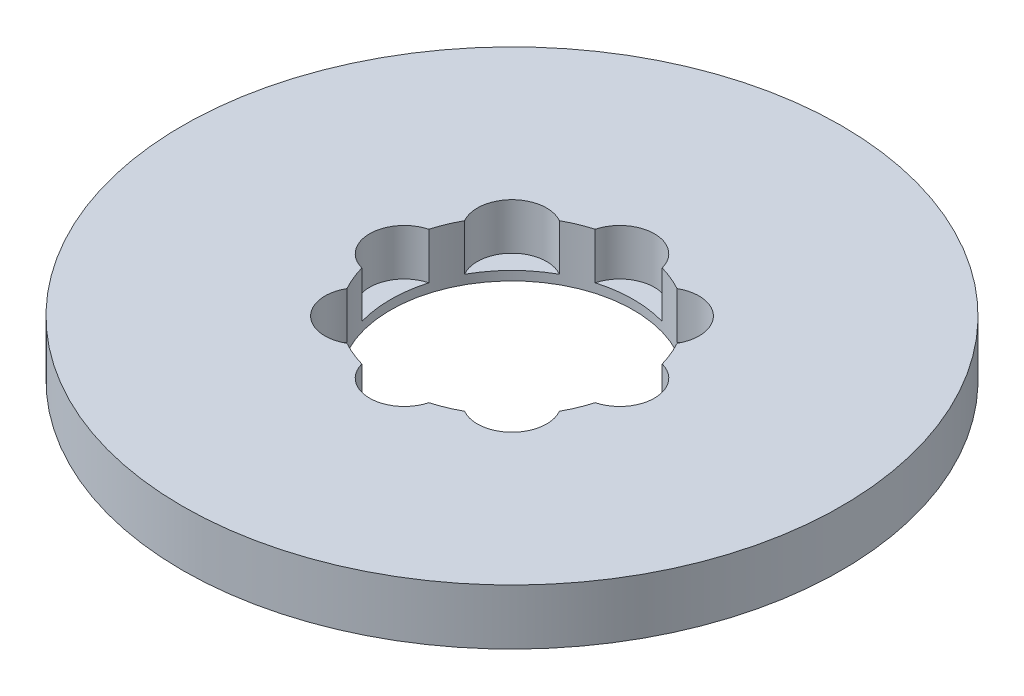
ISO-10303-21;
HEADER;
FILE_DESCRIPTION(('STEP AP214'),'2;1');
FILE_NAME('part.step','',(''),(''),'','','');
FILE_SCHEMA(('AUTOMOTIVE_DESIGN { 1 0 10303 214 1 1 1 1 }'));
ENDSEC;
DATA;
#1=APPLICATION_CONTEXT('core data for automotive mechanical design processes');
#2=APPLICATION_PROTOCOL_DEFINITION('international standard','automotive_design',2000,#1);
#3=PRODUCT_CONTEXT('',#1,'mechanical');
#4=PRODUCT('Part','Part','',(#3));
#5=PRODUCT_RELATED_PRODUCT_CATEGORY('part','',(#4));
#6=PRODUCT_DEFINITION_FORMATION('','',#4);
#7=PRODUCT_DEFINITION_CONTEXT('part definition',#1,'design');
#8=PRODUCT_DEFINITION('design','',#6,#7);
#9=PRODUCT_DEFINITION_SHAPE('','',#8);
#10=(LENGTH_UNIT() NAMED_UNIT(*) SI_UNIT(.MILLI.,.METRE.));
#11=(NAMED_UNIT(*) PLANE_ANGLE_UNIT() SI_UNIT($,.RADIAN.));
#12=(NAMED_UNIT(*) SI_UNIT($,.STERADIAN.) SOLID_ANGLE_UNIT());
#13=UNCERTAINTY_MEASURE_WITH_UNIT(LENGTH_MEASURE(1.E-05),#10,'distance_accuracy_value','');
#14=(GEOMETRIC_REPRESENTATION_CONTEXT(3) GLOBAL_UNCERTAINTY_ASSIGNED_CONTEXT((#13)) GLOBAL_UNIT_ASSIGNED_CONTEXT((#10,
#11,#12)) REPRESENTATION_CONTEXT('',''));
#15=CARTESIAN_POINT('',(0.,0.,0.));
#16=DIRECTION('',(0.,0.,1.));
#17=DIRECTION('',(1.,0.,0.));
#18=AXIS2_PLACEMENT_3D('',#15,#16,#17);
#19=CARTESIAN_POINT('',(0.,16.,0.));
#20=DIRECTION('',(0.,-1.,0.));
#21=DIRECTION('',(0.,0.,-1.));
#22=AXIS2_PLACEMENT_3D('',#19,#20,#21);
#23=CYLINDRICAL_SURFACE('',#22,95.);
#24=CARTESIAN_POINT('',(0.,16.,0.));
#25=DIRECTION('',(0.,1.,0.));
#26=DIRECTION('',(0.,0.,1.));
#27=AXIS2_PLACEMENT_3D('',#24,#25,#26);
#28=CIRCLE('',#27,95.);
#29=CARTESIAN_POINT('',(0.,16.,95.));
#30=VERTEX_POINT('',#29);
#31=EDGE_CURVE('E183',#30,#30,#28,.T.);
#32=ORIENTED_EDGE('',*,*,#31,.F.);
#33=EDGE_LOOP('',(#32));
#34=FACE_BOUND('',#33,.T.);
#35=CARTESIAN_POINT('',(0.,0.,0.));
#36=DIRECTION('',(0.,1.,0.));
#37=DIRECTION('',(0.,0.,1.));
#38=AXIS2_PLACEMENT_3D('',#35,#36,#37);
#39=CIRCLE('',#38,95.);
#40=CARTESIAN_POINT('',(0.,0.,95.));
#41=VERTEX_POINT('',#40);
#42=EDGE_CURVE('E182',#41,#41,#39,.T.);
#43=ORIENTED_EDGE('',*,*,#42,.T.);
#44=EDGE_LOOP('',(#43));
#45=FACE_BOUND('',#44,.T.);
#46=ADVANCED_FACE('F39',(#34,#45),#23,.T.);
#47=CARTESIAN_POINT('',(0.,16.,0.));
#48=DIRECTION('',(0.,1.,0.));
#49=DIRECTION('',(0.,0.,1.));
#50=AXIS2_PLACEMENT_3D('',#47,#48,#49);
#51=PLANE('',#50);
#52=CARTESIAN_POINT('',(1.0843446571775E-13,16.,31.0568653228656));
#53=DIRECTION('',(0.,1.,0.));
#54=DIRECTION('',(1.,0.,0.));
#55=AXIS2_PLACEMENT_3D('',#52,#53,#54);
#56=CIRCLE('',#55,10.);
#57=CARTESIAN_POINT('',(-9.66051258268906,16.,33.6403700431447));
#58=VERTEX_POINT('',#57);
#59=CARTESIAN_POINT('',(9.66051258268929,16.,33.6403700431446));
#60=VERTEX_POINT('',#59);
#61=EDGE_CURVE('E256',#58,#60,#56,.T.);
#62=ORIENTED_EDGE('',*,*,#61,.F.);
#63=CARTESIAN_POINT('',(0.,16.,0.));
#64=DIRECTION('',(0.,1.,0.));
#65=DIRECTION('',(0.,0.,1.));
#66=AXIS2_PLACEMENT_3D('',#63,#64,#65);
#67=CIRCLE('',#66,35.);
#68=CARTESIAN_POINT('',(-16.9563198221748,16.,30.6183477360899));
#69=VERTEX_POINT('',#68);
#70=EDGE_CURVE('E175',#69,#58,#67,.T.);
#71=ORIENTED_EDGE('',*,*,#70,.F.);
#72=CARTESIAN_POINT('',(-21.9605200721956,16.,21.9605200721957));
#73=DIRECTION('',(0.,1.,0.));
#74=DIRECTION('',(0.707106781186549,0.,0.707106781186546));
#75=AXIS2_PLACEMENT_3D('',#72,#73,#74);
#76=CIRCLE('',#75,10.);
#77=CARTESIAN_POINT('',(-30.6183477360898,16.,16.956319822175));
#78=VERTEX_POINT('',#77);
#79=EDGE_CURVE('E152',#78,#69,#76,.T.);
#80=ORIENTED_EDGE('',*,*,#79,.F.);
#81=CARTESIAN_POINT('',(-33.6403700431447,16.,9.66051258268918));
#82=VERTEX_POINT('',#81);
#83=EDGE_CURVE('E168',#82,#78,#67,.T.);
#84=ORIENTED_EDGE('',*,*,#83,.F.);
#85=CARTESIAN_POINT('',(-31.0568653228656,16.,0.));
#86=DIRECTION('',(0.,1.,0.));
#87=DIRECTION('',(0.,0.,1.));
#88=AXIS2_PLACEMENT_3D('',#85,#86,#87);
#89=CIRCLE('',#88,10.);
#90=CARTESIAN_POINT('',(-33.6403700431447,16.,-9.66051258268918));
#91=VERTEX_POINT('',#90);
#92=EDGE_CURVE('E205',#91,#82,#89,.T.);
#93=ORIENTED_EDGE('',*,*,#92,.F.);
#94=CARTESIAN_POINT('',(-30.6183477360901,16.,-16.9563198221745));
#95=VERTEX_POINT('',#94);
#96=EDGE_CURVE('E181',#95,#91,#67,.T.);
#97=ORIENTED_EDGE('',*,*,#96,.F.);
#98=CARTESIAN_POINT('',(-21.9605200721959,16.,-21.9605200721953));
#99=DIRECTION('',(0.,1.,0.));
#100=DIRECTION('',(-0.707106781186539,0.,0.707106781186556));
#101=AXIS2_PLACEMENT_3D('',#98,#99,#100);
#102=CIRCLE('',#101,10.);
#103=CARTESIAN_POINT('',(-16.9563198221753,16.,-30.6183477360897));
#104=VERTEX_POINT('',#103);
#105=EDGE_CURVE('E453',#104,#95,#102,.T.);
#106=ORIENTED_EDGE('',*,*,#105,.F.);
#107=CARTESIAN_POINT('',(-9.66051258268953,16.,-33.6403700431446));
#108=VERTEX_POINT('',#107);
#109=EDGE_CURVE('E189',#108,#104,#67,.T.);
#110=ORIENTED_EDGE('',*,*,#109,.F.);
#111=CARTESIAN_POINT('',(-3.25303397153249E-13,16.,-31.0568653228656));
#112=DIRECTION('',(0.,1.,0.));
#113=DIRECTION('',(-1.,0.,0.));
#114=AXIS2_PLACEMENT_3D('',#111,#112,#113);
#115=CIRCLE('',#114,10.);
#116=CARTESIAN_POINT('',(9.66051258268882,16.,-33.6403700431448));
#117=VERTEX_POINT('',#116);
#118=EDGE_CURVE('E462',#117,#108,#115,.T.);
#119=ORIENTED_EDGE('',*,*,#118,.F.);
#120=CARTESIAN_POINT('',(16.9563198221746,16.,-30.61834773609));
#121=VERTEX_POINT('',#120);
#122=EDGE_CURVE('E197',#121,#117,#67,.T.);
#123=ORIENTED_EDGE('',*,*,#122,.F.);
#124=CARTESIAN_POINT('',(21.9605200721954,16.,-21.9605200721958));
#125=DIRECTION('',(0.,1.,0.));
#126=DIRECTION('',(-0.707106781186554,0.,-0.707106781186541));
#127=AXIS2_PLACEMENT_3D('',#124,#125,#126);
#128=CIRCLE('',#127,10.);
#129=CARTESIAN_POINT('',(30.6183477360897,16.,-16.9563198221752));
#130=VERTEX_POINT('',#129);
#131=EDGE_CURVE('E470',#130,#121,#128,.T.);
#132=ORIENTED_EDGE('',*,*,#131,.F.);
#133=CARTESIAN_POINT('',(33.6403700431447,16.,-9.66051258268918));
#134=VERTEX_POINT('',#133);
#135=EDGE_CURVE('E489',#134,#130,#67,.T.);
#136=ORIENTED_EDGE('',*,*,#135,.F.);
#137=CARTESIAN_POINT('',(31.0568653228656,16.,0.));
#138=DIRECTION('',(0.,1.,0.));
#139=DIRECTION('',(0.,0.,-1.));
#140=AXIS2_PLACEMENT_3D('',#137,#138,#139);
#141=CIRCLE('',#140,10.);
#142=CARTESIAN_POINT('',(33.6403700431447,16.,9.66051258268918));
#143=VERTEX_POINT('',#142);
#144=EDGE_CURVE('E476',#143,#134,#141,.T.);
#145=ORIENTED_EDGE('',*,*,#144,.F.);
#146=CARTESIAN_POINT('',(30.61834773609,16.,16.9563198221747));
#147=VERTEX_POINT('',#146);
#148=EDGE_CURVE('E491',#147,#143,#67,.T.);
#149=ORIENTED_EDGE('',*,*,#148,.F.);
#150=CARTESIAN_POINT('',(21.9605200721957,16.,21.9605200721955));
#151=DIRECTION('',(0.,1.,0.));
#152=DIRECTION('',(0.707106781186544,0.,-0.707106781186551));
#153=AXIS2_PLACEMENT_3D('',#150,#151,#152);
#154=CIRCLE('',#153,10.);
#155=CARTESIAN_POINT('',(16.9563198221751,16.,30.6183477360898));
#156=VERTEX_POINT('',#155);
#157=EDGE_CURVE('E475',#156,#147,#154,.T.);
#158=ORIENTED_EDGE('',*,*,#157,.F.);
#159=EDGE_CURVE('E190',#60,#156,#67,.T.);
#160=ORIENTED_EDGE('',*,*,#159,.F.);
#161=EDGE_LOOP('',(#62,#71,#80,#84,#93,#97,#106,#110,#119,#123,#132,#136,#145,#149,#158,#160));
#162=FACE_BOUND('',#161,.T.);
#163=ORIENTED_EDGE('',*,*,#31,.T.);
#164=EDGE_LOOP('',(#163));
#165=FACE_BOUND('',#164,.T.);
#166=ADVANCED_FACE('F170',(#162,#165),#51,.T.);
#167=CARTESIAN_POINT('',(0.,0.,0.));
#168=DIRECTION('',(0.,1.,0.));
#169=DIRECTION('',(0.,0.,1.));
#170=AXIS2_PLACEMENT_3D('',#167,#168,#169);
#171=PLANE('',#170);
#172=CARTESIAN_POINT('',(0.,0.,0.));
#173=DIRECTION('',(0.,1.,0.));
#174=DIRECTION('',(0.,0.,1.));
#175=AXIS2_PLACEMENT_3D('',#172,#173,#174);
#176=CIRCLE('',#175,35.);
#177=CARTESIAN_POINT('',(0.,0.,35.));
#178=VERTEX_POINT('',#177);
#179=EDGE_CURVE('E191',#178,#178,#176,.T.);
#180=ORIENTED_EDGE('',*,*,#179,.T.);
#181=EDGE_LOOP('',(#180));
#182=FACE_BOUND('',#181,.T.);
#183=ORIENTED_EDGE('',*,*,#42,.F.);
#184=EDGE_LOOP('',(#183));
#185=FACE_BOUND('',#184,.T.);
#186=ADVANCED_FACE('F277',(#182,#185),#171,.F.);
#187=CARTESIAN_POINT('',(0.,16.,0.));
#188=DIRECTION('',(0.,-1.,0.));
#189=DIRECTION('',(0.,0.,-1.));
#190=AXIS2_PLACEMENT_3D('',#187,#188,#189);
#191=CYLINDRICAL_SURFACE('',#190,35.);
#192=DIRECTION('',(0.,1.,0.));
#193=VECTOR('',#192,1.);
#194=CARTESIAN_POINT('',(-9.66051258268906,9.31506286766782,33.6403700431447));
#195=LINE('',#194,#193);
#196=CARTESIAN_POINT('',(-9.66051258268906,2.63012573533564,33.6403700431447));
#197=VERTEX_POINT('',#196);
#198=EDGE_CURVE('E11',#197,#58,#195,.T.);
#199=ORIENTED_EDGE('',*,*,#198,.F.);
#200=CARTESIAN_POINT('',(0.,2.63012573533564,0.));
#201=DIRECTION('',(0.,1.,0.));
#202=DIRECTION('',(0.,0.,1.));
#203=AXIS2_PLACEMENT_3D('',#200,#201,#202);
#204=CIRCLE('',#203,35.);
#205=CARTESIAN_POINT('',(9.66051258268929,2.63012573533564,33.6403700431446));
#206=VERTEX_POINT('',#205);
#207=EDGE_CURVE('E251',#197,#206,#204,.T.);
#208=ORIENTED_EDGE('',*,*,#207,.T.);
#209=DIRECTION('',(0.,1.,0.));
#210=VECTOR('',#209,1.);
#211=CARTESIAN_POINT('',(9.66051258268929,9.31506286766782,33.6403700431446));
#212=LINE('',#211,#210);
#213=EDGE_CURVE('E46',#60,#206,#212,.F.);
#214=ORIENTED_EDGE('',*,*,#213,.F.);
#215=ORIENTED_EDGE('',*,*,#159,.T.);
#216=DIRECTION('',(0.,1.,0.));
#217=VECTOR('',#216,1.);
#218=CARTESIAN_POINT('',(16.9563198221751,9.31506286766782,30.6183477360898));
#219=LINE('',#218,#217);
#220=CARTESIAN_POINT('',(16.9563198221751,2.63012573533564,30.6183477360898));
#221=VERTEX_POINT('',#220);
#222=EDGE_CURVE('E253',#221,#156,#219,.T.);
#223=ORIENTED_EDGE('',*,*,#222,.F.);
#224=CARTESIAN_POINT('',(0.,2.63012573533564,0.));
#225=DIRECTION('',(0.,1.,0.));
#226=DIRECTION('',(0.,0.,1.));
#227=AXIS2_PLACEMENT_3D('',#224,#225,#226);
#228=CIRCLE('',#227,35.);
#229=CARTESIAN_POINT('',(30.61834773609,2.63012573533564,16.9563198221747));
#230=VERTEX_POINT('',#229);
#231=EDGE_CURVE('E246',#221,#230,#228,.T.);
#232=ORIENTED_EDGE('',*,*,#231,.T.);
#233=DIRECTION('',(0.,1.,0.));
#234=VECTOR('',#233,1.);
#235=CARTESIAN_POINT('',(30.61834773609,9.31506286766782,16.9563198221747));
#236=LINE('',#235,#234);
#237=EDGE_CURVE('E248',#147,#230,#236,.F.);
#238=ORIENTED_EDGE('',*,*,#237,.F.);
#239=ORIENTED_EDGE('',*,*,#148,.T.);
#240=DIRECTION('',(0.,1.,0.));
#241=VECTOR('',#240,1.);
#242=CARTESIAN_POINT('',(33.6403700431447,9.31506286766782,9.66051258268918));
#243=LINE('',#242,#241);
#244=CARTESIAN_POINT('',(33.6403700431447,2.63012573533564,9.66051258268918));
#245=VERTEX_POINT('',#244);
#246=EDGE_CURVE('E243',#245,#143,#243,.T.);
#247=ORIENTED_EDGE('',*,*,#246,.F.);
#248=CARTESIAN_POINT('',(0.,2.63012573533564,0.));
#249=DIRECTION('',(0.,1.,0.));
#250=DIRECTION('',(0.,0.,1.));
#251=AXIS2_PLACEMENT_3D('',#248,#249,#250);
#252=CIRCLE('',#251,35.);
#253=CARTESIAN_POINT('',(33.6403700431447,2.63012573533564,-9.66051258268918));
#254=VERTEX_POINT('',#253);
#255=EDGE_CURVE('E236',#245,#254,#252,.T.);
#256=ORIENTED_EDGE('',*,*,#255,.T.);
#257=DIRECTION('',(0.,1.,0.));
#258=VECTOR('',#257,1.);
#259=CARTESIAN_POINT('',(33.6403700431447,9.31506286766782,-9.66051258268918));
#260=LINE('',#259,#258);
#261=EDGE_CURVE('E241',#134,#254,#260,.F.);
#262=ORIENTED_EDGE('',*,*,#261,.F.);
#263=ORIENTED_EDGE('',*,*,#135,.T.);
#264=DIRECTION('',(0.,1.,0.));
#265=VECTOR('',#264,1.);
#266=CARTESIAN_POINT('',(30.6183477360897,9.31506286766782,-16.9563198221752));
#267=LINE('',#266,#265);
#268=CARTESIAN_POINT('',(30.6183477360897,2.63012573533564,-16.9563198221752));
#269=VERTEX_POINT('',#268);
#270=EDGE_CURVE('E237',#269,#130,#267,.T.);
#271=ORIENTED_EDGE('',*,*,#270,.F.);
#272=CARTESIAN_POINT('',(0.,2.63012573533564,0.));
#273=DIRECTION('',(0.,1.,0.));
#274=DIRECTION('',(0.,0.,1.));
#275=AXIS2_PLACEMENT_3D('',#272,#273,#274);
#276=CIRCLE('',#275,35.);
#277=CARTESIAN_POINT('',(16.9563198221746,2.63012573533564,-30.61834773609));
#278=VERTEX_POINT('',#277);
#279=EDGE_CURVE('E229',#269,#278,#276,.T.);
#280=ORIENTED_EDGE('',*,*,#279,.T.);
#281=DIRECTION('',(0.,1.,0.));
#282=VECTOR('',#281,1.);
#283=CARTESIAN_POINT('',(16.9563198221746,9.31506286766782,-30.61834773609));
#284=LINE('',#283,#282);
#285=EDGE_CURVE('E232',#121,#278,#284,.F.);
#286=ORIENTED_EDGE('',*,*,#285,.F.);
#287=ORIENTED_EDGE('',*,*,#122,.T.);
#288=DIRECTION('',(0.,1.,0.));
#289=VECTOR('',#288,1.);
#290=CARTESIAN_POINT('',(9.66051258268882,9.31506286766782,-33.6403700431448));
#291=LINE('',#290,#289);
#292=CARTESIAN_POINT('',(9.66051258268882,2.63012573533564,-33.6403700431448));
#293=VERTEX_POINT('',#292);
#294=EDGE_CURVE('E227',#293,#117,#291,.T.);
#295=ORIENTED_EDGE('',*,*,#294,.F.);
#296=CARTESIAN_POINT('',(0.,2.63012573533564,0.));
#297=DIRECTION('',(0.,1.,0.));
#298=DIRECTION('',(0.,0.,1.));
#299=AXIS2_PLACEMENT_3D('',#296,#297,#298);
#300=CIRCLE('',#299,35.);
#301=CARTESIAN_POINT('',(-9.66051258268953,2.63012573533564,-33.6403700431446));
#302=VERTEX_POINT('',#301);
#303=EDGE_CURVE('E225',#293,#302,#300,.T.);
#304=ORIENTED_EDGE('',*,*,#303,.T.);
#305=DIRECTION('',(0.,1.,0.));
#306=VECTOR('',#305,1.);
#307=CARTESIAN_POINT('',(-9.66051258268953,9.31506286766782,-33.6403700431446));
#308=LINE('',#307,#306);
#309=EDGE_CURVE('E223',#108,#302,#308,.F.);
#310=ORIENTED_EDGE('',*,*,#309,.F.);
#311=ORIENTED_EDGE('',*,*,#109,.T.);
#312=DIRECTION('',(0.,1.,0.));
#313=VECTOR('',#312,1.);
#314=CARTESIAN_POINT('',(-16.9563198221753,9.31506286766782,-30.6183477360897));
#315=LINE('',#314,#313);
#316=CARTESIAN_POINT('',(-16.9563198221753,2.63012573533564,-30.6183477360897));
#317=VERTEX_POINT('',#316);
#318=EDGE_CURVE('E219',#317,#104,#315,.T.);
#319=ORIENTED_EDGE('',*,*,#318,.F.);
#320=CARTESIAN_POINT('',(0.,2.63012573533564,0.));
#321=DIRECTION('',(0.,1.,0.));
#322=DIRECTION('',(0.,0.,1.));
#323=AXIS2_PLACEMENT_3D('',#320,#321,#322);
#324=CIRCLE('',#323,35.);
#325=CARTESIAN_POINT('',(-30.6183477360901,2.63012573533564,-16.9563198221745));
#326=VERTEX_POINT('',#325);
#327=EDGE_CURVE('E159',#317,#326,#324,.T.);
#328=ORIENTED_EDGE('',*,*,#327,.T.);
#329=DIRECTION('',(0.,1.,0.));
#330=VECTOR('',#329,1.);
#331=CARTESIAN_POINT('',(-30.6183477360901,9.31506286766782,-16.9563198221745));
#332=LINE('',#331,#330);
#333=EDGE_CURVE('E220',#95,#326,#332,.F.);
#334=ORIENTED_EDGE('',*,*,#333,.F.);
#335=ORIENTED_EDGE('',*,*,#96,.T.);
#336=DIRECTION('',(0.,1.,0.));
#337=VECTOR('',#336,1.);
#338=CARTESIAN_POINT('',(-33.6403700431447,9.31506286766782,-9.66051258268918));
#339=LINE('',#338,#337);
#340=CARTESIAN_POINT('',(-33.6403700431447,2.63012573533564,-9.66051258268918));
#341=VERTEX_POINT('',#340);
#342=EDGE_CURVE('E209',#341,#91,#339,.T.);
#343=ORIENTED_EDGE('',*,*,#342,.F.);
#344=CARTESIAN_POINT('',(0.,2.63012573533564,0.));
#345=DIRECTION('',(0.,1.,0.));
#346=DIRECTION('',(0.,0.,1.));
#347=AXIS2_PLACEMENT_3D('',#344,#345,#346);
#348=CIRCLE('',#347,35.);
#349=CARTESIAN_POINT('',(-33.6403700431447,2.63012573533564,9.66051258268918));
#350=VERTEX_POINT('',#349);
#351=EDGE_CURVE('E206',#341,#350,#348,.T.);
#352=ORIENTED_EDGE('',*,*,#351,.T.);
#353=DIRECTION('',(0.,1.,0.));
#354=VECTOR('',#353,1.);
#355=CARTESIAN_POINT('',(-33.6403700431447,9.31506286766782,9.66051258268918));
#356=LINE('',#355,#354);
#357=EDGE_CURVE('E179',#82,#350,#356,.F.);
#358=ORIENTED_EDGE('',*,*,#357,.F.);
#359=ORIENTED_EDGE('',*,*,#83,.T.);
#360=DIRECTION('',(0.,1.,0.));
#361=VECTOR('',#360,1.);
#362=CARTESIAN_POINT('',(-30.6183477360898,9.31506286766782,16.956319822175));
#363=LINE('',#362,#361);
#364=CARTESIAN_POINT('',(-30.6183477360898,2.63012573533564,16.956319822175));
#365=VERTEX_POINT('',#364);
#366=EDGE_CURVE('E147',#365,#78,#363,.T.);
#367=ORIENTED_EDGE('',*,*,#366,.F.);
#368=CARTESIAN_POINT('',(0.,2.63012573533564,0.));
#369=DIRECTION('',(0.,1.,0.));
#370=DIRECTION('',(0.,0.,1.));
#371=AXIS2_PLACEMENT_3D('',#368,#369,#370);
#372=CIRCLE('',#371,35.);
#373=CARTESIAN_POINT('',(-16.9563198221748,2.63012573533564,30.6183477360899));
#374=VERTEX_POINT('',#373);
#375=EDGE_CURVE('E215',#365,#374,#372,.T.);
#376=ORIENTED_EDGE('',*,*,#375,.T.);
#377=DIRECTION('',(0.,1.,0.));
#378=VECTOR('',#377,1.);
#379=CARTESIAN_POINT('',(-16.9563198221748,9.31506286766782,30.6183477360899));
#380=LINE('',#379,#378);
#381=EDGE_CURVE('E161',#69,#374,#380,.F.);
#382=ORIENTED_EDGE('',*,*,#381,.F.);
#383=ORIENTED_EDGE('',*,*,#70,.T.);
#384=EDGE_LOOP('',(#199,#208,#214,#215,#223,#232,#238,#239,#247,#256,#262,#263,#271,#280,#286,
#287,#295,#304,#310,#311,#319,#328,#334,#335,#343,#352,#358,#359,#367,#376,#382,#383));
#385=FACE_BOUND('',#384,.T.);
#386=ORIENTED_EDGE('',*,*,#179,.F.);
#387=EDGE_LOOP('',(#386));
#388=FACE_BOUND('',#387,.T.);
#389=ADVANCED_FACE('F176',(#385,#388),#191,.F.);
#390=CARTESIAN_POINT('',(-31.0568653228656,2.63012573533564,0.));
#391=DIRECTION('',(0.,1.,0.));
#392=DIRECTION('',(0.,0.,1.));
#393=AXIS2_PLACEMENT_3D('',#390,#391,#392);
#394=CYLINDRICAL_SURFACE('',#393,10.);
#395=ORIENTED_EDGE('',*,*,#342,.T.);
#396=ORIENTED_EDGE('',*,*,#92,.T.);
#397=ORIENTED_EDGE('',*,*,#357,.T.);
#398=CARTESIAN_POINT('',(-31.0568653228656,2.63012573533564,0.));
#399=DIRECTION('',(0.,1.,0.));
#400=DIRECTION('',(0.,0.,1.));
#401=AXIS2_PLACEMENT_3D('',#398,#399,#400);
#402=CIRCLE('',#401,10.);
#403=EDGE_CURVE('E200',#341,#350,#402,.T.);
#404=ORIENTED_EDGE('',*,*,#403,.F.);
#405=EDGE_LOOP('',(#395,#396,#397,#404));
#406=FACE_BOUND('',#405,.T.);
#407=ADVANCED_FACE('F286',(#406),#394,.F.);
#408=CARTESIAN_POINT('',(-31.0568653228656,2.63012573533564,0.));
#409=DIRECTION('',(0.,1.,0.));
#410=DIRECTION('',(0.,0.,1.));
#411=AXIS2_PLACEMENT_3D('',#408,#409,#410);
#412=PLANE('',#411);
#413=ORIENTED_EDGE('',*,*,#403,.T.);
#414=ORIENTED_EDGE('',*,*,#351,.F.);
#415=EDGE_LOOP('',(#413,#414));
#416=FACE_BOUND('',#415,.T.);
#417=ADVANCED_FACE('F289',(#416),#412,.T.);
#418=CARTESIAN_POINT('',(-21.9605200721956,2.63012573533564,21.9605200721957));
#419=DIRECTION('',(0.,1.,0.));
#420=DIRECTION('',(0.,0.,1.));
#421=AXIS2_PLACEMENT_3D('',#418,#419,#420);
#422=CYLINDRICAL_SURFACE('',#421,10.);
#423=ORIENTED_EDGE('',*,*,#366,.T.);
#424=ORIENTED_EDGE('',*,*,#79,.T.);
#425=ORIENTED_EDGE('',*,*,#381,.T.);
#426=CARTESIAN_POINT('',(-21.9605200721956,2.63012573533564,21.9605200721957));
#427=DIRECTION('',(0.,1.,0.));
#428=DIRECTION('',(0.707106781186549,0.,0.707106781186546));
#429=AXIS2_PLACEMENT_3D('',#426,#427,#428);
#430=CIRCLE('',#429,10.);
#431=EDGE_CURVE('E156',#365,#374,#430,.T.);
#432=ORIENTED_EDGE('',*,*,#431,.F.);
#433=EDGE_LOOP('',(#423,#424,#425,#432));
#434=FACE_BOUND('',#433,.T.);
#435=ADVANCED_FACE('F155',(#434),#422,.F.);
#436=CARTESIAN_POINT('',(-21.9605200721956,2.63012573533564,21.9605200721957));
#437=DIRECTION('',(0.,1.,0.));
#438=DIRECTION('',(0.707106781186549,0.,0.707106781186546));
#439=AXIS2_PLACEMENT_3D('',#436,#437,#438);
#440=PLANE('',#439);
#441=ORIENTED_EDGE('',*,*,#431,.T.);
#442=ORIENTED_EDGE('',*,*,#375,.F.);
#443=EDGE_LOOP('',(#441,#442));
#444=FACE_BOUND('',#443,.T.);
#445=ADVANCED_FACE('F300',(#444),#440,.T.);
#446=CARTESIAN_POINT('',(-21.9605200721959,2.63012573533564,-21.9605200721953));
#447=DIRECTION('',(0.,1.,0.));
#448=DIRECTION('',(0.,0.,1.));
#449=AXIS2_PLACEMENT_3D('',#446,#447,#448);
#450=CYLINDRICAL_SURFACE('',#449,10.);
#451=ORIENTED_EDGE('',*,*,#318,.T.);
#452=ORIENTED_EDGE('',*,*,#105,.T.);
#453=ORIENTED_EDGE('',*,*,#333,.T.);
#454=CARTESIAN_POINT('',(-21.9605200721959,2.63012573533564,-21.9605200721953));
#455=DIRECTION('',(0.,1.,0.));
#456=DIRECTION('',(-0.707106781186539,0.,0.707106781186556));
#457=AXIS2_PLACEMENT_3D('',#454,#455,#456);
#458=CIRCLE('',#457,10.);
#459=EDGE_CURVE('E454',#317,#326,#458,.T.);
#460=ORIENTED_EDGE('',*,*,#459,.F.);
#461=EDGE_LOOP('',(#451,#452,#453,#460));
#462=FACE_BOUND('',#461,.T.);
#463=ADVANCED_FACE('F299',(#462),#450,.F.);
#464=CARTESIAN_POINT('',(-21.9605200721959,2.63012573533564,-21.9605200721953));
#465=DIRECTION('',(0.,1.,0.));
#466=DIRECTION('',(-0.707106781186539,0.,0.707106781186556));
#467=AXIS2_PLACEMENT_3D('',#464,#465,#466);
#468=PLANE('',#467);
#469=ORIENTED_EDGE('',*,*,#459,.T.);
#470=ORIENTED_EDGE('',*,*,#327,.F.);
#471=EDGE_LOOP('',(#469,#470));
#472=FACE_BOUND('',#471,.T.);
#473=ADVANCED_FACE('F379',(#472),#468,.T.);
#474=CARTESIAN_POINT('',(-3.25303397153249E-13,2.63012573533564,-31.0568653228656));
#475=DIRECTION('',(0.,1.,0.));
#476=DIRECTION('',(0.,0.,1.));
#477=AXIS2_PLACEMENT_3D('',#474,#475,#476);
#478=CYLINDRICAL_SURFACE('',#477,10.);
#479=ORIENTED_EDGE('',*,*,#294,.T.);
#480=ORIENTED_EDGE('',*,*,#118,.T.);
#481=ORIENTED_EDGE('',*,*,#309,.T.);
#482=CARTESIAN_POINT('',(-3.25303397153249E-13,2.63012573533564,-31.0568653228656));
#483=DIRECTION('',(0.,1.,0.));
#484=DIRECTION('',(-1.,0.,0.));
#485=AXIS2_PLACEMENT_3D('',#482,#483,#484);
#486=CIRCLE('',#485,10.);
#487=EDGE_CURVE('E465',#293,#302,#486,.T.);
#488=ORIENTED_EDGE('',*,*,#487,.F.);
#489=EDGE_LOOP('',(#479,#480,#481,#488));
#490=FACE_BOUND('',#489,.T.);
#491=ADVANCED_FACE('F371',(#490),#478,.F.);
#492=CARTESIAN_POINT('',(-3.25303397153249E-13,2.63012573533564,-31.0568653228656));
#493=DIRECTION('',(0.,1.,0.));
#494=DIRECTION('',(-1.,0.,0.));
#495=AXIS2_PLACEMENT_3D('',#492,#493,#494);
#496=PLANE('',#495);
#497=ORIENTED_EDGE('',*,*,#487,.T.);
#498=ORIENTED_EDGE('',*,*,#303,.F.);
#499=EDGE_LOOP('',(#497,#498));
#500=FACE_BOUND('',#499,.T.);
#501=ADVANCED_FACE('F308',(#500),#496,.T.);
#502=CARTESIAN_POINT('',(21.9605200721954,2.63012573533564,-21.9605200721958));
#503=DIRECTION('',(0.,1.,0.));
#504=DIRECTION('',(0.,0.,1.));
#505=AXIS2_PLACEMENT_3D('',#502,#503,#504);
#506=CYLINDRICAL_SURFACE('',#505,10.);
#507=ORIENTED_EDGE('',*,*,#270,.T.);
#508=ORIENTED_EDGE('',*,*,#131,.T.);
#509=ORIENTED_EDGE('',*,*,#285,.T.);
#510=CARTESIAN_POINT('',(21.9605200721954,2.63012573533564,-21.9605200721958));
#511=DIRECTION('',(0.,1.,0.));
#512=DIRECTION('',(-0.707106781186554,0.,-0.707106781186541));
#513=AXIS2_PLACEMENT_3D('',#510,#511,#512);
#514=CIRCLE('',#513,10.);
#515=EDGE_CURVE('E477',#269,#278,#514,.T.);
#516=ORIENTED_EDGE('',*,*,#515,.F.);
#517=EDGE_LOOP('',(#507,#508,#509,#516));
#518=FACE_BOUND('',#517,.T.);
#519=ADVANCED_FACE('F305',(#518),#506,.F.);
#520=CARTESIAN_POINT('',(21.9605200721954,2.63012573533564,-21.9605200721958));
#521=DIRECTION('',(0.,1.,0.));
#522=DIRECTION('',(-0.707106781186554,0.,-0.707106781186541));
#523=AXIS2_PLACEMENT_3D('',#520,#521,#522);
#524=PLANE('',#523);
#525=ORIENTED_EDGE('',*,*,#515,.T.);
#526=ORIENTED_EDGE('',*,*,#279,.F.);
#527=EDGE_LOOP('',(#525,#526));
#528=FACE_BOUND('',#527,.T.);
#529=ADVANCED_FACE('F304',(#528),#524,.T.);
#530=CARTESIAN_POINT('',(31.0568653228656,2.63012573533564,0.));
#531=DIRECTION('',(0.,1.,0.));
#532=DIRECTION('',(0.,0.,1.));
#533=AXIS2_PLACEMENT_3D('',#530,#531,#532);
#534=CYLINDRICAL_SURFACE('',#533,10.);
#535=ORIENTED_EDGE('',*,*,#246,.T.);
#536=ORIENTED_EDGE('',*,*,#144,.T.);
#537=ORIENTED_EDGE('',*,*,#261,.T.);
#538=CARTESIAN_POINT('',(31.0568653228656,2.63012573533564,0.));
#539=DIRECTION('',(0.,1.,0.));
#540=DIRECTION('',(0.,0.,-1.));
#541=AXIS2_PLACEMENT_3D('',#538,#539,#540);
#542=CIRCLE('',#541,10.);
#543=EDGE_CURVE('E478',#245,#254,#542,.T.);
#544=ORIENTED_EDGE('',*,*,#543,.F.);
#545=EDGE_LOOP('',(#535,#536,#537,#544));
#546=FACE_BOUND('',#545,.T.);
#547=ADVANCED_FACE('F309',(#546),#534,.F.);
#548=CARTESIAN_POINT('',(31.0568653228656,2.63012573533564,0.));
#549=DIRECTION('',(0.,1.,0.));
#550=DIRECTION('',(0.,0.,-1.));
#551=AXIS2_PLACEMENT_3D('',#548,#549,#550);
#552=PLANE('',#551);
#553=ORIENTED_EDGE('',*,*,#543,.T.);
#554=ORIENTED_EDGE('',*,*,#255,.F.);
#555=EDGE_LOOP('',(#553,#554));
#556=FACE_BOUND('',#555,.T.);
#557=ADVANCED_FACE('F314',(#556),#552,.T.);
#558=CARTESIAN_POINT('',(21.9605200721957,2.63012573533564,21.9605200721955));
#559=DIRECTION('',(0.,1.,0.));
#560=DIRECTION('',(0.,0.,1.));
#561=AXIS2_PLACEMENT_3D('',#558,#559,#560);
#562=CYLINDRICAL_SURFACE('',#561,10.);
#563=ORIENTED_EDGE('',*,*,#222,.T.);
#564=ORIENTED_EDGE('',*,*,#157,.T.);
#565=ORIENTED_EDGE('',*,*,#237,.T.);
#566=CARTESIAN_POINT('',(21.9605200721957,2.63012573533564,21.9605200721955));
#567=DIRECTION('',(0.,1.,0.));
#568=DIRECTION('',(0.707106781186544,0.,-0.707106781186551));
#569=AXIS2_PLACEMENT_3D('',#566,#567,#568);
#570=CIRCLE('',#569,10.);
#571=EDGE_CURVE('E56',#221,#230,#570,.T.);
#572=ORIENTED_EDGE('',*,*,#571,.F.);
#573=EDGE_LOOP('',(#563,#564,#565,#572));
#574=FACE_BOUND('',#573,.T.);
#575=ADVANCED_FACE('F318',(#574),#562,.F.);
#576=CARTESIAN_POINT('',(21.9605200721957,2.63012573533564,21.9605200721955));
#577=DIRECTION('',(0.,1.,0.));
#578=DIRECTION('',(0.707106781186544,0.,-0.707106781186551));
#579=AXIS2_PLACEMENT_3D('',#576,#577,#578);
#580=PLANE('',#579);
#581=ORIENTED_EDGE('',*,*,#571,.T.);
#582=ORIENTED_EDGE('',*,*,#231,.F.);
#583=EDGE_LOOP('',(#581,#582));
#584=FACE_BOUND('',#583,.T.);
#585=ADVANCED_FACE('F270',(#584),#580,.T.);
#586=CARTESIAN_POINT('',(1.0843446571775E-13,2.63012573533564,31.0568653228656));
#587=DIRECTION('',(0.,1.,0.));
#588=DIRECTION('',(0.,0.,1.));
#589=AXIS2_PLACEMENT_3D('',#586,#587,#588);
#590=CYLINDRICAL_SURFACE('',#589,10.);
#591=ORIENTED_EDGE('',*,*,#198,.T.);
#592=ORIENTED_EDGE('',*,*,#61,.T.);
#593=ORIENTED_EDGE('',*,*,#213,.T.);
#594=CARTESIAN_POINT('',(1.0843446571775E-13,2.63012573533564,31.0568653228656));
#595=DIRECTION('',(0.,1.,0.));
#596=DIRECTION('',(1.,0.,0.));
#597=AXIS2_PLACEMENT_3D('',#594,#595,#596);
#598=CIRCLE('',#597,10.);
#599=EDGE_CURVE('E55',#197,#206,#598,.T.);
#600=ORIENTED_EDGE('',*,*,#599,.F.);
#601=EDGE_LOOP('',(#591,#592,#593,#600));
#602=FACE_BOUND('',#601,.T.);
#603=ADVANCED_FACE('F260',(#602),#590,.F.);
#604=CARTESIAN_POINT('',(1.0843446571775E-13,2.63012573533564,31.0568653228656));
#605=DIRECTION('',(0.,1.,0.));
#606=DIRECTION('',(1.,0.,0.));
#607=AXIS2_PLACEMENT_3D('',#604,#605,#606);
#608=PLANE('',#607);
#609=ORIENTED_EDGE('',*,*,#599,.T.);
#610=ORIENTED_EDGE('',*,*,#207,.F.);
#611=EDGE_LOOP('',(#609,#610));
#612=FACE_BOUND('',#611,.T.);
#613=ADVANCED_FACE('F261',(#612),#608,.T.);
#614=CLOSED_SHELL('',(#46,#166,#186,#389,#407,#417,#435,#445,#463,#473,#491,#501,#519,#529,#547,
#557,#575,#585,#603,#613));
#615=MANIFOLD_SOLID_BREP('B2',#614);
#616=ADVANCED_BREP_SHAPE_REPRESENTATION('',(#18,#615),#14);
#617=SHAPE_DEFINITION_REPRESENTATION(#9,#616);
ENDSEC;
END-ISO-10303-21;
